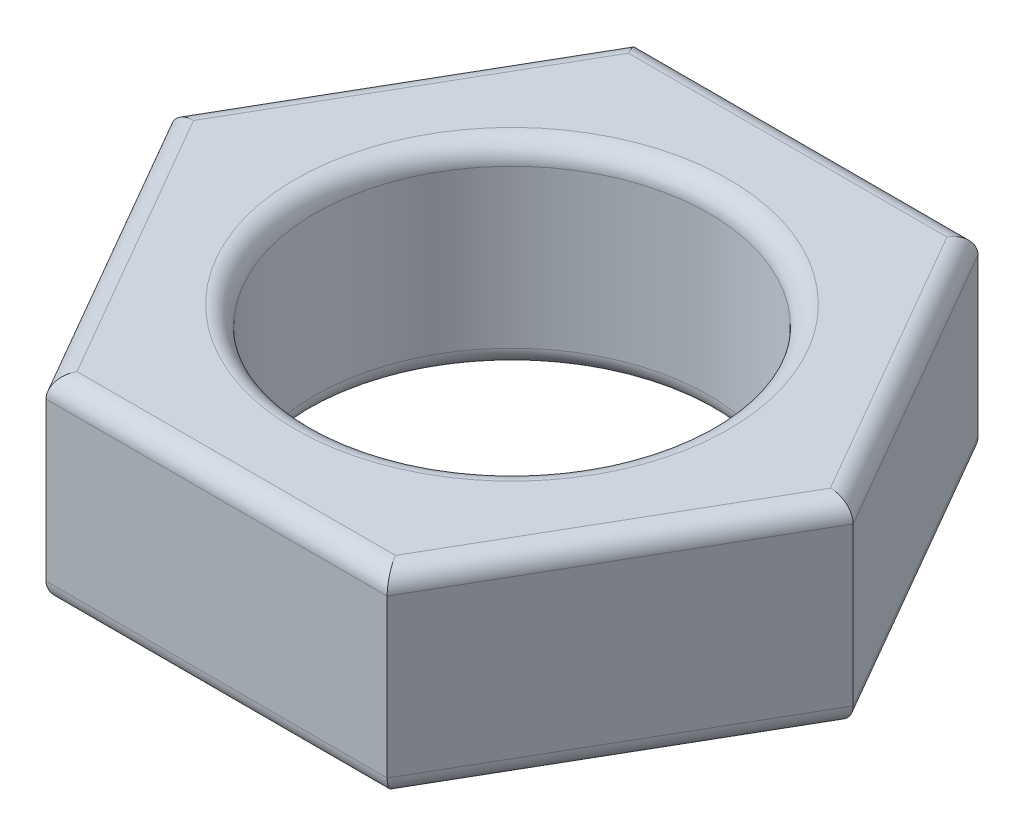
ISO-10303-21;
HEADER;
FILE_DESCRIPTION(('STEP AP214'),'2;1');
FILE_NAME('part.step','',(''),(''),'','','');
FILE_SCHEMA(('AUTOMOTIVE_DESIGN { 1 0 10303 214 1 1 1 1 }'));
ENDSEC;
DATA;
#1=APPLICATION_CONTEXT('core data for automotive mechanical design processes');
#2=APPLICATION_PROTOCOL_DEFINITION('international standard','automotive_design',2000,#1);
#3=PRODUCT_CONTEXT('',#1,'mechanical');
#4=PRODUCT('Part','Part','',(#3));
#5=PRODUCT_RELATED_PRODUCT_CATEGORY('part','',(#4));
#6=PRODUCT_DEFINITION_FORMATION('','',#4);
#7=PRODUCT_DEFINITION_CONTEXT('part definition',#1,'design');
#8=PRODUCT_DEFINITION('design','',#6,#7);
#9=PRODUCT_DEFINITION_SHAPE('','',#8);
#10=(LENGTH_UNIT() NAMED_UNIT(*) SI_UNIT(.MILLI.,.METRE.));
#11=(NAMED_UNIT(*) PLANE_ANGLE_UNIT() SI_UNIT($,.RADIAN.));
#12=(NAMED_UNIT(*) SI_UNIT($,.STERADIAN.) SOLID_ANGLE_UNIT());
#13=UNCERTAINTY_MEASURE_WITH_UNIT(LENGTH_MEASURE(1.E-05),#10,'distance_accuracy_value','');
#14=(GEOMETRIC_REPRESENTATION_CONTEXT(3) GLOBAL_UNCERTAINTY_ASSIGNED_CONTEXT((#13)) GLOBAL_UNIT_ASSIGNED_CONTEXT((#10,
#11,#12)) REPRESENTATION_CONTEXT('',''));
#15=CARTESIAN_POINT('',(0.,0.,0.));
#16=DIRECTION('',(0.,0.,1.));
#17=DIRECTION('',(1.,0.,0.));
#18=AXIS2_PLACEMENT_3D('',#15,#16,#17);
#19=CARTESIAN_POINT('',(0.,5.,0.));
#20=DIRECTION('',(0.,1.,0.));
#21=DIRECTION('',(0.,0.,1.));
#22=AXIS2_PLACEMENT_3D('',#19,#20,#21);
#23=PLANE('',#22);
#24=CARTESIAN_POINT('',(0.,5.,0.));
#25=DIRECTION('',(0.,1.,0.));
#26=DIRECTION('',(0.,0.,1.));
#27=AXIS2_PLACEMENT_3D('',#24,#25,#26);
#28=CIRCLE('',#27,5.5);
#29=CARTESIAN_POINT('',(0.,5.,5.5));
#30=VERTEX_POINT('',#29);
#31=EDGE_CURVE('E11',#30,#30,#28,.F.);
#32=ORIENTED_EDGE('',*,*,#31,.T.);
#33=EDGE_LOOP('',(#32));
#34=FACE_BOUND('',#33,.T.);
#35=DIRECTION('',(-0.5,0.,0.866025403784439));
#36=VECTOR('',#35,1.);
#37=CARTESIAN_POINT('',(-8.22724133595217,5.,0.25));
#38=LINE('',#37,#36);
#39=CARTESIAN_POINT('',(-4.04145188432738,5.,-7.));
#40=VERTEX_POINT('',#39);
#41=CARTESIAN_POINT('',(-8.08290376865476,5.,0.));
#42=VERTEX_POINT('',#41);
#43=EDGE_CURVE('E49',#40,#42,#38,.T.);
#44=ORIENTED_EDGE('',*,*,#43,.T.);
#45=DIRECTION('',(0.5,0.,0.866025403784439));
#46=VECTOR('',#45,1.);
#47=CARTESIAN_POINT('',(-3.89711431702998,5.,7.25));
#48=LINE('',#47,#46);
#49=CARTESIAN_POINT('',(-4.04145188432738,5.,7.));
#50=VERTEX_POINT('',#49);
#51=EDGE_CURVE('E41',#42,#50,#48,.T.);
#52=ORIENTED_EDGE('',*,*,#51,.T.);
#53=DIRECTION('',(1.,0.,0.));
#54=VECTOR('',#53,1.);
#55=CARTESIAN_POINT('',(4.33012701892219,5.,7.));
#56=LINE('',#55,#54);
#57=CARTESIAN_POINT('',(4.04145188432738,5.,7.));
#58=VERTEX_POINT('',#57);
#59=EDGE_CURVE('E188',#50,#58,#56,.T.);
#60=ORIENTED_EDGE('',*,*,#59,.T.);
#61=DIRECTION('',(0.5,0.,-0.866025403784439));
#62=VECTOR('',#61,1.);
#63=CARTESIAN_POINT('',(8.22724133595217,5.,-0.25));
#64=LINE('',#63,#62);
#65=CARTESIAN_POINT('',(8.08290376865476,5.,0.));
#66=VERTEX_POINT('',#65);
#67=EDGE_CURVE('E190',#58,#66,#64,.T.);
#68=ORIENTED_EDGE('',*,*,#67,.T.);
#69=DIRECTION('',(-0.5,0.,-0.866025403784439));
#70=VECTOR('',#69,1.);
#71=CARTESIAN_POINT('',(3.89711431702997,5.,-7.25));
#72=LINE('',#71,#70);
#73=CARTESIAN_POINT('',(4.04145188432738,5.,-7.));
#74=VERTEX_POINT('',#73);
#75=EDGE_CURVE('E192',#66,#74,#72,.T.);
#76=ORIENTED_EDGE('',*,*,#75,.T.);
#77=DIRECTION('',(-1.,0.,0.));
#78=VECTOR('',#77,1.);
#79=CARTESIAN_POINT('',(-4.33012701892219,5.,-7.));
#80=LINE('',#79,#78);
#81=EDGE_CURVE('E54',#74,#40,#80,.T.);
#82=ORIENTED_EDGE('',*,*,#81,.T.);
#83=EDGE_LOOP('',(#44,#52,#60,#68,#76,#82));
#84=FACE_BOUND('',#83,.T.);
#85=ADVANCED_FACE('F32',(#34,#84),#23,.T.);
#86=CARTESIAN_POINT('',(0.,0.,0.));
#87=DIRECTION('',(0.,1.,0.));
#88=DIRECTION('',(0.,0.,1.));
#89=AXIS2_PLACEMENT_3D('',#86,#87,#88);
#90=PLANE('',#89);
#91=CARTESIAN_POINT('',(0.,0.,0.));
#92=DIRECTION('',(0.,1.,0.));
#93=DIRECTION('',(0.,0.,1.));
#94=AXIS2_PLACEMENT_3D('',#91,#92,#93);
#95=CIRCLE('',#94,5.5);
#96=CARTESIAN_POINT('',(0.,0.,5.5));
#97=VERTEX_POINT('',#96);
#98=EDGE_CURVE('E150',#97,#97,#95,.T.);
#99=ORIENTED_EDGE('',*,*,#98,.T.);
#100=EDGE_LOOP('',(#99));
#101=FACE_BOUND('',#100,.T.);
#102=DIRECTION('',(-0.5,0.,-0.866025403784439));
#103=VECTOR('',#102,1.);
#104=CARTESIAN_POINT('',(6.06217782649107,0.,-3.5));
#105=LINE('',#104,#103);
#106=CARTESIAN_POINT('',(4.04145188432738,0.,-7.));
#107=VERTEX_POINT('',#106);
#108=CARTESIAN_POINT('',(8.08290376865476,0.,0.));
#109=VERTEX_POINT('',#108);
#110=EDGE_CURVE('E149',#107,#109,#105,.F.);
#111=ORIENTED_EDGE('',*,*,#110,.T.);
#112=DIRECTION('',(0.5,0.,-0.866025403784439));
#113=VECTOR('',#112,1.);
#114=CARTESIAN_POINT('',(6.06217782649107,0.,3.5));
#115=LINE('',#114,#113);
#116=CARTESIAN_POINT('',(4.04145188432738,0.,7.));
#117=VERTEX_POINT('',#116);
#118=EDGE_CURVE('E128',#109,#117,#115,.F.);
#119=ORIENTED_EDGE('',*,*,#118,.T.);
#120=DIRECTION('',(1.,0.,0.));
#121=VECTOR('',#120,1.);
#122=CARTESIAN_POINT('',(0.,0.,7.));
#123=LINE('',#122,#121);
#124=CARTESIAN_POINT('',(-4.04145188432738,0.,7.));
#125=VERTEX_POINT('',#124);
#126=EDGE_CURVE('E138',#117,#125,#123,.F.);
#127=ORIENTED_EDGE('',*,*,#126,.T.);
#128=DIRECTION('',(0.5,0.,0.866025403784439));
#129=VECTOR('',#128,1.);
#130=CARTESIAN_POINT('',(-6.06217782649107,0.,3.5));
#131=LINE('',#130,#129);
#132=CARTESIAN_POINT('',(-8.08290376865476,0.,0.));
#133=VERTEX_POINT('',#132);
#134=EDGE_CURVE('E144',#125,#133,#131,.F.);
#135=ORIENTED_EDGE('',*,*,#134,.T.);
#136=DIRECTION('',(-0.5,0.,0.866025403784439));
#137=VECTOR('',#136,1.);
#138=CARTESIAN_POINT('',(-6.06217782649107,0.,-3.5));
#139=LINE('',#138,#137);
#140=CARTESIAN_POINT('',(-4.04145188432738,0.,-7.));
#141=VERTEX_POINT('',#140);
#142=EDGE_CURVE('E250',#133,#141,#139,.F.);
#143=ORIENTED_EDGE('',*,*,#142,.T.);
#144=DIRECTION('',(-1.,0.,0.));
#145=VECTOR('',#144,1.);
#146=CARTESIAN_POINT('',(0.,0.,-7.));
#147=LINE('',#146,#145);
#148=EDGE_CURVE('E155',#141,#107,#147,.F.);
#149=ORIENTED_EDGE('',*,*,#148,.T.);
#150=EDGE_LOOP('',(#111,#119,#127,#135,#143,#149));
#151=FACE_BOUND('',#150,.T.);
#152=ADVANCED_FACE('F147',(#101,#151),#90,.F.);
#153=CARTESIAN_POINT('',(-4.3301270189222,5.,7.5));
#154=DIRECTION('',(0.,0.,-1.));
#155=DIRECTION('',(-1.,0.,0.));
#156=AXIS2_PLACEMENT_3D('',#153,#154,#155);
#157=PLANE('',#156);
#158=DIRECTION('',(0.,-1.,0.));
#159=VECTOR('',#158,1.);
#160=CARTESIAN_POINT('',(-4.3301270189222,5.,7.5));
#161=LINE('',#160,#159);
#162=CARTESIAN_POINT('',(-4.3301270189222,4.5,7.5));
#163=VERTEX_POINT('',#162);
#164=CARTESIAN_POINT('',(-4.3301270189222,0.5,7.5));
#165=VERTEX_POINT('',#164);
#166=EDGE_CURVE('E207',#163,#165,#161,.T.);
#167=ORIENTED_EDGE('',*,*,#166,.T.);
#168=DIRECTION('',(1.,0.,0.));
#169=VECTOR('',#168,1.);
#170=CARTESIAN_POINT('',(-4.3301270189222,0.5,7.5));
#171=LINE('',#170,#169);
#172=CARTESIAN_POINT('',(4.33012701892219,0.5,7.5));
#173=VERTEX_POINT('',#172);
#174=EDGE_CURVE('E186',#165,#173,#171,.T.);
#175=ORIENTED_EDGE('',*,*,#174,.T.);
#176=DIRECTION('',(0.,-1.,0.));
#177=VECTOR('',#176,1.);
#178=CARTESIAN_POINT('',(4.33012701892219,5.,7.5));
#179=LINE('',#178,#177);
#180=CARTESIAN_POINT('',(4.33012701892219,4.5,7.5));
#181=VERTEX_POINT('',#180);
#182=EDGE_CURVE('E145',#181,#173,#179,.T.);
#183=ORIENTED_EDGE('',*,*,#182,.F.);
#184=DIRECTION('',(1.,0.,0.));
#185=VECTOR('',#184,1.);
#186=CARTESIAN_POINT('',(-4.3301270189222,4.5,7.5));
#187=LINE('',#186,#185);
#188=EDGE_CURVE('E184',#181,#163,#187,.F.);
#189=ORIENTED_EDGE('',*,*,#188,.T.);
#190=EDGE_LOOP('',(#167,#175,#183,#189));
#191=FACE_BOUND('',#190,.T.);
#192=ADVANCED_FACE('F274',(#191),#157,.F.);
#193=CARTESIAN_POINT('',(4.33012701892219,5.,7.5));
#194=DIRECTION('',(-0.866025403784439,0.,-0.5));
#195=DIRECTION('',(-0.5,0.,0.866025403784439));
#196=AXIS2_PLACEMENT_3D('',#193,#194,#195);
#197=PLANE('',#196);
#198=ORIENTED_EDGE('',*,*,#182,.T.);
#199=DIRECTION('',(0.5,0.,-0.866025403784439));
#200=VECTOR('',#199,1.);
#201=CARTESIAN_POINT('',(4.33012701892219,0.5,7.5));
#202=LINE('',#201,#200);
#203=CARTESIAN_POINT('',(8.66025403784439,0.5,0.));
#204=VERTEX_POINT('',#203);
#205=EDGE_CURVE('E131',#173,#204,#202,.T.);
#206=ORIENTED_EDGE('',*,*,#205,.T.);
#207=DIRECTION('',(0.,-1.,0.));
#208=VECTOR('',#207,1.);
#209=CARTESIAN_POINT('',(8.66025403784439,5.,0.));
#210=LINE('',#209,#208);
#211=CARTESIAN_POINT('',(8.66025403784439,4.5,0.));
#212=VERTEX_POINT('',#211);
#213=EDGE_CURVE('E236',#212,#204,#210,.T.);
#214=ORIENTED_EDGE('',*,*,#213,.F.);
#215=DIRECTION('',(0.5,0.,-0.866025403784439));
#216=VECTOR('',#215,1.);
#217=CARTESIAN_POINT('',(4.33012701892219,4.5,7.5));
#218=LINE('',#217,#216);
#219=EDGE_CURVE('E164',#212,#181,#218,.F.);
#220=ORIENTED_EDGE('',*,*,#219,.T.);
#221=EDGE_LOOP('',(#198,#206,#214,#220));
#222=FACE_BOUND('',#221,.T.);
#223=ADVANCED_FACE('F241',(#222),#197,.F.);
#224=CARTESIAN_POINT('',(8.66025403784439,5.,0.));
#225=DIRECTION('',(-0.866025403784439,0.,0.5));
#226=DIRECTION('',(0.5,0.,0.866025403784439));
#227=AXIS2_PLACEMENT_3D('',#224,#225,#226);
#228=PLANE('',#227);
#229=ORIENTED_EDGE('',*,*,#213,.T.);
#230=DIRECTION('',(-0.5,0.,-0.866025403784439));
#231=VECTOR('',#230,1.);
#232=CARTESIAN_POINT('',(8.66025403784439,0.5,0.));
#233=LINE('',#232,#231);
#234=CARTESIAN_POINT('',(4.33012701892219,0.5,-7.5));
#235=VERTEX_POINT('',#234);
#236=EDGE_CURVE('E169',#204,#235,#233,.T.);
#237=ORIENTED_EDGE('',*,*,#236,.T.);
#238=DIRECTION('',(0.,-1.,0.));
#239=VECTOR('',#238,1.);
#240=CARTESIAN_POINT('',(4.33012701892219,5.,-7.5));
#241=LINE('',#240,#239);
#242=CARTESIAN_POINT('',(4.33012701892219,4.5,-7.5));
#243=VERTEX_POINT('',#242);
#244=EDGE_CURVE('E238',#243,#235,#241,.T.);
#245=ORIENTED_EDGE('',*,*,#244,.F.);
#246=DIRECTION('',(-0.5,0.,-0.866025403784439));
#247=VECTOR('',#246,1.);
#248=CARTESIAN_POINT('',(8.66025403784439,4.5,0.));
#249=LINE('',#248,#247);
#250=EDGE_CURVE('E167',#243,#212,#249,.F.);
#251=ORIENTED_EDGE('',*,*,#250,.T.);
#252=EDGE_LOOP('',(#229,#237,#245,#251));
#253=FACE_BOUND('',#252,.T.);
#254=ADVANCED_FACE('F235',(#253),#228,.F.);
#255=CARTESIAN_POINT('',(4.33012701892219,5.,-7.5));
#256=DIRECTION('',(0.,0.,1.));
#257=DIRECTION('',(1.,0.,0.));
#258=AXIS2_PLACEMENT_3D('',#255,#256,#257);
#259=PLANE('',#258);
#260=ORIENTED_EDGE('',*,*,#244,.T.);
#261=DIRECTION('',(-1.,0.,0.));
#262=VECTOR('',#261,1.);
#263=CARTESIAN_POINT('',(4.33012701892219,0.5,-7.5));
#264=LINE('',#263,#262);
#265=CARTESIAN_POINT('',(-4.33012701892219,0.5,-7.5));
#266=VERTEX_POINT('',#265);
#267=EDGE_CURVE('E173',#235,#266,#264,.T.);
#268=ORIENTED_EDGE('',*,*,#267,.T.);
#269=DIRECTION('',(0.,-1.,0.));
#270=VECTOR('',#269,1.);
#271=CARTESIAN_POINT('',(-4.33012701892219,5.,-7.5));
#272=LINE('',#271,#270);
#273=CARTESIAN_POINT('',(-4.33012701892219,4.5,-7.5));
#274=VERTEX_POINT('',#273);
#275=EDGE_CURVE('E245',#274,#266,#272,.T.);
#276=ORIENTED_EDGE('',*,*,#275,.F.);
#277=DIRECTION('',(-1.,0.,0.));
#278=VECTOR('',#277,1.);
#279=CARTESIAN_POINT('',(4.33012701892219,4.5,-7.5));
#280=LINE('',#279,#278);
#281=EDGE_CURVE('E171',#274,#243,#280,.F.);
#282=ORIENTED_EDGE('',*,*,#281,.T.);
#283=EDGE_LOOP('',(#260,#268,#276,#282));
#284=FACE_BOUND('',#283,.T.);
#285=ADVANCED_FACE('F262',(#284),#259,.F.);
#286=CARTESIAN_POINT('',(-4.33012701892219,5.,-7.5));
#287=DIRECTION('',(0.866025403784438,0.,0.5));
#288=DIRECTION('',(0.5,0.,-0.866025403784439));
#289=AXIS2_PLACEMENT_3D('',#286,#287,#288);
#290=PLANE('',#289);
#291=ORIENTED_EDGE('',*,*,#275,.T.);
#292=DIRECTION('',(-0.5,0.,0.866025403784439));
#293=VECTOR('',#292,1.);
#294=CARTESIAN_POINT('',(-4.33012701892219,0.5,-7.5));
#295=LINE('',#294,#293);
#296=CARTESIAN_POINT('',(-8.66025403784439,0.5,0.));
#297=VERTEX_POINT('',#296);
#298=EDGE_CURVE('E177',#266,#297,#295,.T.);
#299=ORIENTED_EDGE('',*,*,#298,.T.);
#300=DIRECTION('',(0.,-1.,0.));
#301=VECTOR('',#300,1.);
#302=CARTESIAN_POINT('',(-8.66025403784439,5.,0.));
#303=LINE('',#302,#301);
#304=CARTESIAN_POINT('',(-8.66025403784439,4.5,0.));
#305=VERTEX_POINT('',#304);
#306=EDGE_CURVE('E267',#305,#297,#303,.T.);
#307=ORIENTED_EDGE('',*,*,#306,.F.);
#308=DIRECTION('',(-0.5,0.,0.866025403784439));
#309=VECTOR('',#308,1.);
#310=CARTESIAN_POINT('',(-4.33012701892219,4.5,-7.5));
#311=LINE('',#310,#309);
#312=EDGE_CURVE('E175',#305,#274,#311,.F.);
#313=ORIENTED_EDGE('',*,*,#312,.T.);
#314=EDGE_LOOP('',(#291,#299,#307,#313));
#315=FACE_BOUND('',#314,.T.);
#316=ADVANCED_FACE('F285',(#315),#290,.F.);
#317=CARTESIAN_POINT('',(-8.66025403784439,5.,0.));
#318=DIRECTION('',(0.866025403784439,0.,-0.5));
#319=DIRECTION('',(-0.5,0.,-0.866025403784439));
#320=AXIS2_PLACEMENT_3D('',#317,#318,#319);
#321=PLANE('',#320);
#322=ORIENTED_EDGE('',*,*,#306,.T.);
#323=DIRECTION('',(0.5,0.,0.866025403784439));
#324=VECTOR('',#323,1.);
#325=CARTESIAN_POINT('',(-8.66025403784439,0.5,0.));
#326=LINE('',#325,#324);
#327=EDGE_CURVE('E182',#297,#165,#326,.T.);
#328=ORIENTED_EDGE('',*,*,#327,.T.);
#329=ORIENTED_EDGE('',*,*,#166,.F.);
#330=DIRECTION('',(0.5,0.,0.866025403784439));
#331=VECTOR('',#330,1.);
#332=CARTESIAN_POINT('',(-8.66025403784439,4.5,0.));
#333=LINE('',#332,#331);
#334=EDGE_CURVE('E179',#163,#305,#333,.F.);
#335=ORIENTED_EDGE('',*,*,#334,.T.);
#336=EDGE_LOOP('',(#322,#328,#329,#335));
#337=FACE_BOUND('',#336,.T.);
#338=ADVANCED_FACE('F286',(#337),#321,.F.);
#339=CARTESIAN_POINT('',(0.,5.,0.));
#340=DIRECTION('',(0.,-1.,0.));
#341=DIRECTION('',(0.,0.,-1.));
#342=AXIS2_PLACEMENT_3D('',#339,#340,#341);
#343=CYLINDRICAL_SURFACE('',#342,5.);
#344=CARTESIAN_POINT('',(0.,0.5,0.));
#345=DIRECTION('',(0.,1.,0.));
#346=DIRECTION('',(0.,0.,1.));
#347=AXIS2_PLACEMENT_3D('',#344,#345,#346);
#348=CIRCLE('',#347,5.);
#349=CARTESIAN_POINT('',(0.,0.5,5.));
#350=VERTEX_POINT('',#349);
#351=EDGE_CURVE('E161',#350,#350,#348,.F.);
#352=ORIENTED_EDGE('',*,*,#351,.T.);
#353=EDGE_LOOP('',(#352));
#354=FACE_BOUND('',#353,.T.);
#355=CARTESIAN_POINT('',(0.,4.5,0.));
#356=DIRECTION('',(0.,1.,0.));
#357=DIRECTION('',(0.,0.,1.));
#358=AXIS2_PLACEMENT_3D('',#355,#356,#357);
#359=CIRCLE('',#358,5.);
#360=CARTESIAN_POINT('',(0.,4.5,5.));
#361=VERTEX_POINT('',#360);
#362=EDGE_CURVE('E153',#361,#361,#359,.T.);
#363=ORIENTED_EDGE('',*,*,#362,.T.);
#364=EDGE_LOOP('',(#363));
#365=FACE_BOUND('',#364,.T.);
#366=ADVANCED_FACE('F305',(#354,#365),#343,.F.);
#367=CARTESIAN_POINT('',(0.,0.5,0.));
#368=DIRECTION('',(0.,1.,0.));
#369=DIRECTION('',(0.,0.,1.));
#370=AXIS2_PLACEMENT_3D('',#367,#368,#369);
#371=TOROIDAL_SURFACE('',#370,5.5,0.5);
#372=ORIENTED_EDGE('',*,*,#351,.F.);
#373=EDGE_LOOP('',(#372));
#374=FACE_BOUND('',#373,.T.);
#375=ORIENTED_EDGE('',*,*,#98,.F.);
#376=EDGE_LOOP('',(#375));
#377=FACE_BOUND('',#376,.T.);
#378=ADVANCED_FACE('F319',(#374,#377),#371,.T.);
#379=CARTESIAN_POINT('',(-3.89711431702997,0.5,-7.25));
#380=DIRECTION('',(-0.5,0.,0.866025403784439));
#381=DIRECTION('',(0.866025403784438,0.,0.5));
#382=AXIS2_PLACEMENT_3D('',#379,#380,#381);
#383=CYLINDRICAL_SURFACE('',#382,0.5);
#384=CARTESIAN_POINT('',(-4.04145188432738,0.5,-7.));
#385=DIRECTION('',(-0.866025403784439,0.,0.5));
#386=DIRECTION('',(0.5,0.,0.866025403784439));
#387=AXIS2_PLACEMENT_3D('',#384,#385,#386);
#388=ELLIPSE('',#387,0.577350269189626,0.5);
#389=EDGE_CURVE('E201',#141,#266,#388,.F.);
#390=ORIENTED_EDGE('',*,*,#389,.F.);
#391=ORIENTED_EDGE('',*,*,#142,.F.);
#392=CARTESIAN_POINT('',(-8.08290376865476,0.5,0.));
#393=DIRECTION('',(0.,0.,1.));
#394=DIRECTION('',(1.,0.,0.));
#395=AXIS2_PLACEMENT_3D('',#392,#393,#394);
#396=ELLIPSE('',#395,0.577350269189626,0.5);
#397=EDGE_CURVE('E204',#297,#133,#396,.T.);
#398=ORIENTED_EDGE('',*,*,#397,.F.);
#399=ORIENTED_EDGE('',*,*,#298,.F.);
#400=EDGE_LOOP('',(#390,#391,#398,#399));
#401=FACE_BOUND('',#400,.T.);
#402=ADVANCED_FACE('F283',(#401),#383,.T.);
#403=CARTESIAN_POINT('',(-8.22724133595217,0.5,-0.250000000000002));
#404=DIRECTION('',(0.5,0.,0.866025403784439));
#405=DIRECTION('',(0.866025403784439,0.,-0.5));
#406=AXIS2_PLACEMENT_3D('',#403,#404,#405);
#407=CYLINDRICAL_SURFACE('',#406,0.5);
#408=ORIENTED_EDGE('',*,*,#397,.T.);
#409=ORIENTED_EDGE('',*,*,#134,.F.);
#410=CARTESIAN_POINT('',(-4.04145188432738,0.5,7.));
#411=DIRECTION('',(0.866025403784439,0.,0.5));
#412=DIRECTION('',(0.5,0.,-0.866025403784439));
#413=AXIS2_PLACEMENT_3D('',#410,#411,#412);
#414=ELLIPSE('',#413,0.577350269189626,0.5);
#415=EDGE_CURVE('E141',#165,#125,#414,.T.);
#416=ORIENTED_EDGE('',*,*,#415,.F.);
#417=ORIENTED_EDGE('',*,*,#327,.F.);
#418=EDGE_LOOP('',(#408,#409,#416,#417));
#419=FACE_BOUND('',#418,.T.);
#420=ADVANCED_FACE('F280',(#419),#407,.T.);
#421=CARTESIAN_POINT('',(4.33012701892219,0.5,-7.));
#422=DIRECTION('',(-1.,0.,0.));
#423=DIRECTION('',(0.,0.,1.));
#424=AXIS2_PLACEMENT_3D('',#421,#422,#423);
#425=CYLINDRICAL_SURFACE('',#424,0.5);
#426=ORIENTED_EDGE('',*,*,#389,.T.);
#427=ORIENTED_EDGE('',*,*,#267,.F.);
#428=CARTESIAN_POINT('',(4.04145188432738,0.5,-7.));
#429=DIRECTION('',(-0.866025403784439,0.,-0.5));
#430=DIRECTION('',(-0.5,0.,0.866025403784439));
#431=AXIS2_PLACEMENT_3D('',#428,#429,#430);
#432=ELLIPSE('',#431,0.577350269189626,0.5);
#433=EDGE_CURVE('E134',#107,#235,#432,.F.);
#434=ORIENTED_EDGE('',*,*,#433,.F.);
#435=ORIENTED_EDGE('',*,*,#148,.F.);
#436=EDGE_LOOP('',(#426,#427,#434,#435));
#437=FACE_BOUND('',#436,.T.);
#438=ADVANCED_FACE('F257',(#437),#425,.T.);
#439=CARTESIAN_POINT('',(-4.3301270189222,0.5,7.));
#440=DIRECTION('',(1.,0.,0.));
#441=DIRECTION('',(0.,0.,-1.));
#442=AXIS2_PLACEMENT_3D('',#439,#440,#441);
#443=CYLINDRICAL_SURFACE('',#442,0.5);
#444=ORIENTED_EDGE('',*,*,#415,.T.);
#445=ORIENTED_EDGE('',*,*,#126,.F.);
#446=CARTESIAN_POINT('',(4.04145188432738,0.5,7.));
#447=DIRECTION('',(0.866025403784439,0.,-0.5));
#448=DIRECTION('',(0.5,0.,0.866025403784439));
#449=AXIS2_PLACEMENT_3D('',#446,#447,#448);
#450=ELLIPSE('',#449,0.577350269189626,0.5);
#451=EDGE_CURVE('E124',#173,#117,#450,.T.);
#452=ORIENTED_EDGE('',*,*,#451,.F.);
#453=ORIENTED_EDGE('',*,*,#174,.F.);
#454=EDGE_LOOP('',(#444,#445,#452,#453));
#455=FACE_BOUND('',#454,.T.);
#456=ADVANCED_FACE('F139',(#455),#443,.T.);
#457=CARTESIAN_POINT('',(8.22724133595217,0.5,0.250000000000002));
#458=DIRECTION('',(-0.5,0.,-0.866025403784439));
#459=DIRECTION('',(-0.866025403784439,0.,0.5));
#460=AXIS2_PLACEMENT_3D('',#457,#458,#459);
#461=CYLINDRICAL_SURFACE('',#460,0.5);
#462=ORIENTED_EDGE('',*,*,#433,.T.);
#463=ORIENTED_EDGE('',*,*,#236,.F.);
#464=CARTESIAN_POINT('',(8.08290376865476,0.5,0.));
#465=DIRECTION('',(0.,0.,-1.));
#466=DIRECTION('',(-1.,0.,0.));
#467=AXIS2_PLACEMENT_3D('',#464,#465,#466);
#468=ELLIPSE('',#467,0.577350269189626,0.5);
#469=EDGE_CURVE('E135',#109,#204,#468,.F.);
#470=ORIENTED_EDGE('',*,*,#469,.F.);
#471=ORIENTED_EDGE('',*,*,#110,.F.);
#472=EDGE_LOOP('',(#462,#463,#470,#471));
#473=FACE_BOUND('',#472,.T.);
#474=ADVANCED_FACE('F260',(#473),#461,.T.);
#475=CARTESIAN_POINT('',(3.89711431702997,0.5,7.25));
#476=DIRECTION('',(0.5,0.,-0.866025403784439));
#477=DIRECTION('',(-0.866025403784439,0.,-0.5));
#478=AXIS2_PLACEMENT_3D('',#475,#476,#477);
#479=CYLINDRICAL_SURFACE('',#478,0.5);
#480=ORIENTED_EDGE('',*,*,#451,.T.);
#481=ORIENTED_EDGE('',*,*,#118,.F.);
#482=ORIENTED_EDGE('',*,*,#469,.T.);
#483=ORIENTED_EDGE('',*,*,#205,.F.);
#484=EDGE_LOOP('',(#480,#481,#482,#483));
#485=FACE_BOUND('',#484,.T.);
#486=ADVANCED_FACE('F126',(#485),#479,.T.);
#487=CARTESIAN_POINT('',(0.,4.5,0.));
#488=DIRECTION('',(0.,1.,0.));
#489=DIRECTION('',(0.,0.,1.));
#490=AXIS2_PLACEMENT_3D('',#487,#488,#489);
#491=TOROIDAL_SURFACE('',#490,5.5,0.5);
#492=ORIENTED_EDGE('',*,*,#31,.F.);
#493=EDGE_LOOP('',(#492));
#494=FACE_BOUND('',#493,.T.);
#495=ORIENTED_EDGE('',*,*,#362,.F.);
#496=EDGE_LOOP('',(#495));
#497=FACE_BOUND('',#496,.T.);
#498=ADVANCED_FACE('F325',(#494,#497),#491,.T.);
#499=CARTESIAN_POINT('',(6.06217782649107,4.5,-3.5));
#500=DIRECTION('',(0.5,0.,0.866025403784439));
#501=DIRECTION('',(0.866025403784439,0.,-0.5));
#502=AXIS2_PLACEMENT_3D('',#499,#500,#501);
#503=CYLINDRICAL_SURFACE('',#502,0.5);
#504=CARTESIAN_POINT('',(8.08290376865476,4.5,0.));
#505=DIRECTION('',(0.,0.,1.));
#506=DIRECTION('',(-1.,0.,0.));
#507=AXIS2_PLACEMENT_3D('',#504,#505,#506);
#508=ELLIPSE('',#507,0.577350269189626,0.5);
#509=EDGE_CURVE('E217',#212,#66,#508,.T.);
#510=ORIENTED_EDGE('',*,*,#509,.F.);
#511=ORIENTED_EDGE('',*,*,#250,.F.);
#512=CARTESIAN_POINT('',(4.04145188432738,4.5,-7.));
#513=DIRECTION('',(0.866025403784439,0.,0.5));
#514=DIRECTION('',(-0.5,0.,0.866025403784439));
#515=AXIS2_PLACEMENT_3D('',#512,#513,#514);
#516=ELLIPSE('',#515,0.577350269189626,0.5);
#517=EDGE_CURVE('E36',#74,#243,#516,.F.);
#518=ORIENTED_EDGE('',*,*,#517,.F.);
#519=ORIENTED_EDGE('',*,*,#75,.F.);
#520=EDGE_LOOP('',(#510,#511,#518,#519));
#521=FACE_BOUND('',#520,.T.);
#522=ADVANCED_FACE('F34',(#521),#503,.T.);
#523=CARTESIAN_POINT('',(0.,4.5,-7.));
#524=DIRECTION('',(1.,0.,0.));
#525=DIRECTION('',(0.,0.,-1.));
#526=AXIS2_PLACEMENT_3D('',#523,#524,#525);
#527=CYLINDRICAL_SURFACE('',#526,0.5);
#528=ORIENTED_EDGE('',*,*,#517,.T.);
#529=ORIENTED_EDGE('',*,*,#281,.F.);
#530=CARTESIAN_POINT('',(-4.04145188432738,4.5,-7.));
#531=DIRECTION('',(0.866025403784439,0.,-0.5));
#532=DIRECTION('',(0.5,0.,0.866025403784439));
#533=AXIS2_PLACEMENT_3D('',#530,#531,#532);
#534=ELLIPSE('',#533,0.577350269189626,0.5);
#535=EDGE_CURVE('E215',#40,#274,#534,.F.);
#536=ORIENTED_EDGE('',*,*,#535,.F.);
#537=ORIENTED_EDGE('',*,*,#81,.F.);
#538=EDGE_LOOP('',(#528,#529,#536,#537));
#539=FACE_BOUND('',#538,.T.);
#540=ADVANCED_FACE('F227',(#539),#527,.T.);
#541=CARTESIAN_POINT('',(6.06217782649107,4.5,3.5));
#542=DIRECTION('',(-0.5,0.,0.866025403784439));
#543=DIRECTION('',(0.866025403784439,0.,0.5));
#544=AXIS2_PLACEMENT_3D('',#541,#542,#543);
#545=CYLINDRICAL_SURFACE('',#544,0.5);
#546=ORIENTED_EDGE('',*,*,#509,.T.);
#547=ORIENTED_EDGE('',*,*,#67,.F.);
#548=CARTESIAN_POINT('',(4.04145188432738,4.5,7.));
#549=DIRECTION('',(-0.866025403784439,0.,0.5));
#550=DIRECTION('',(-0.5,0.,-0.866025403784439));
#551=AXIS2_PLACEMENT_3D('',#548,#549,#550);
#552=ELLIPSE('',#551,0.577350269189626,0.5);
#553=EDGE_CURVE('E212',#181,#58,#552,.T.);
#554=ORIENTED_EDGE('',*,*,#553,.F.);
#555=ORIENTED_EDGE('',*,*,#219,.F.);
#556=EDGE_LOOP('',(#546,#547,#554,#555));
#557=FACE_BOUND('',#556,.T.);
#558=ADVANCED_FACE('F346',(#557),#545,.T.);
#559=CARTESIAN_POINT('',(-6.06217782649107,4.5,-3.5));
#560=DIRECTION('',(0.5,0.,-0.866025403784439));
#561=DIRECTION('',(-0.866025403784438,0.,-0.5));
#562=AXIS2_PLACEMENT_3D('',#559,#560,#561);
#563=CYLINDRICAL_SURFACE('',#562,0.5);
#564=ORIENTED_EDGE('',*,*,#535,.T.);
#565=ORIENTED_EDGE('',*,*,#312,.F.);
#566=CARTESIAN_POINT('',(-8.08290376865476,4.5,0.));
#567=DIRECTION('',(0.,0.,-1.));
#568=DIRECTION('',(1.,0.,0.));
#569=AXIS2_PLACEMENT_3D('',#566,#567,#568);
#570=ELLIPSE('',#569,0.577350269189626,0.5);
#571=EDGE_CURVE('E210',#42,#305,#570,.F.);
#572=ORIENTED_EDGE('',*,*,#571,.F.);
#573=ORIENTED_EDGE('',*,*,#43,.F.);
#574=EDGE_LOOP('',(#564,#565,#572,#573));
#575=FACE_BOUND('',#574,.T.);
#576=ADVANCED_FACE('F343',(#575),#563,.T.);
#577=CARTESIAN_POINT('',(0.,4.5,7.));
#578=DIRECTION('',(-1.,0.,0.));
#579=DIRECTION('',(0.,0.,1.));
#580=AXIS2_PLACEMENT_3D('',#577,#578,#579);
#581=CYLINDRICAL_SURFACE('',#580,0.5);
#582=ORIENTED_EDGE('',*,*,#553,.T.);
#583=ORIENTED_EDGE('',*,*,#59,.F.);
#584=CARTESIAN_POINT('',(-4.04145188432738,4.5,7.));
#585=DIRECTION('',(-0.866025403784439,0.,-0.5));
#586=DIRECTION('',(-0.5,0.,0.866025403784439));
#587=AXIS2_PLACEMENT_3D('',#584,#585,#586);
#588=ELLIPSE('',#587,0.577350269189626,0.5);
#589=EDGE_CURVE('E208',#163,#50,#588,.T.);
#590=ORIENTED_EDGE('',*,*,#589,.F.);
#591=ORIENTED_EDGE('',*,*,#188,.F.);
#592=EDGE_LOOP('',(#582,#583,#590,#591));
#593=FACE_BOUND('',#592,.T.);
#594=ADVANCED_FACE('F294',(#593),#581,.T.);
#595=CARTESIAN_POINT('',(-6.06217782649107,4.5,3.5));
#596=DIRECTION('',(-0.5,0.,-0.866025403784439));
#597=DIRECTION('',(-0.866025403784439,0.,0.5));
#598=AXIS2_PLACEMENT_3D('',#595,#596,#597);
#599=CYLINDRICAL_SURFACE('',#598,0.5);
#600=ORIENTED_EDGE('',*,*,#571,.T.);
#601=ORIENTED_EDGE('',*,*,#334,.F.);
#602=ORIENTED_EDGE('',*,*,#589,.T.);
#603=ORIENTED_EDGE('',*,*,#51,.F.);
#604=EDGE_LOOP('',(#600,#601,#602,#603));
#605=FACE_BOUND('',#604,.T.);
#606=ADVANCED_FACE('F289',(#605),#599,.T.);
#607=CLOSED_SHELL('',(#85,#152,#192,#223,#254,#285,#316,#338,#366,#378,#402,#420,#438,#456,#474,
#486,#498,#522,#540,#558,#576,#594,#606));
#608=MANIFOLD_SOLID_BREP('B2',#607);
#609=ADVANCED_BREP_SHAPE_REPRESENTATION('',(#18,#608),#14);
#610=SHAPE_DEFINITION_REPRESENTATION(#9,#609);
ENDSEC;
END-ISO-10303-21;
